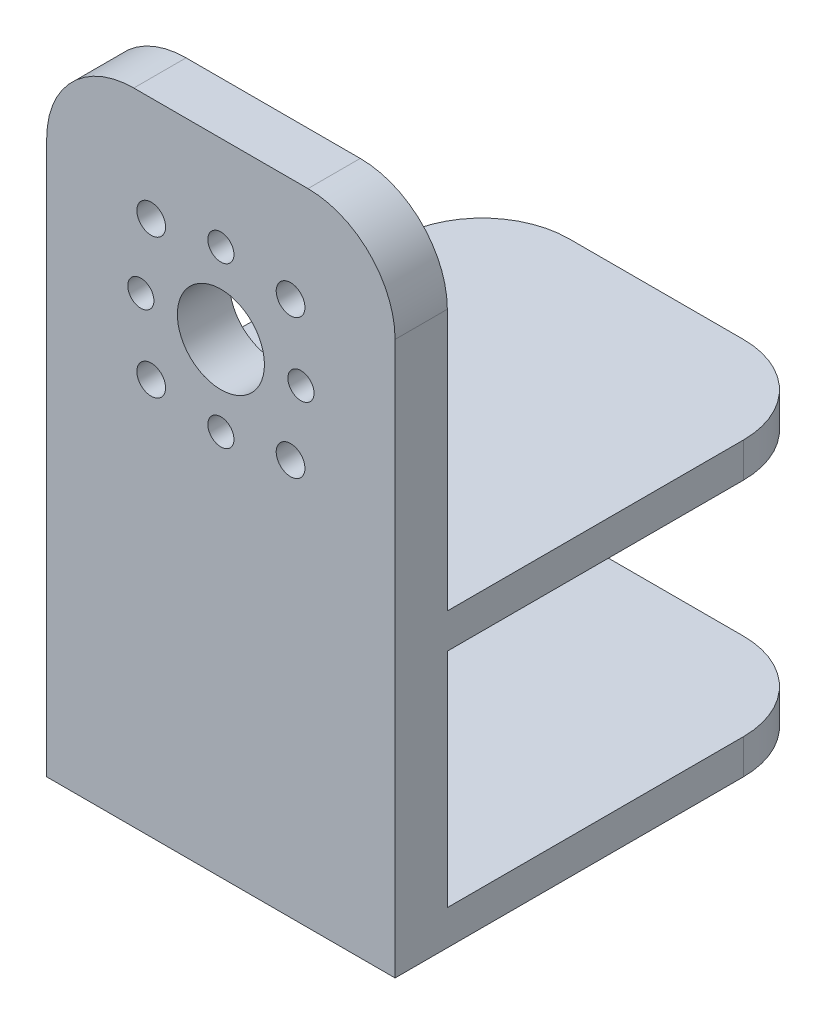
ISO-10303-21;
HEADER;
FILE_DESCRIPTION(('STEP AP214'),'2;1');
FILE_NAME('part.step','',(''),(''),'','','');
FILE_SCHEMA(('AUTOMOTIVE_DESIGN { 1 0 10303 214 1 1 1 1 }'));
ENDSEC;
DATA;
#1=APPLICATION_CONTEXT('core data for automotive mechanical design processes');
#2=APPLICATION_PROTOCOL_DEFINITION('international standard','automotive_design',2000,#1);
#3=PRODUCT_CONTEXT('',#1,'mechanical');
#4=PRODUCT('Part','Part','',(#3));
#5=PRODUCT_RELATED_PRODUCT_CATEGORY('part','',(#4));
#6=PRODUCT_DEFINITION_FORMATION('','',#4);
#7=PRODUCT_DEFINITION_CONTEXT('part definition',#1,'design');
#8=PRODUCT_DEFINITION('design','',#6,#7);
#9=PRODUCT_DEFINITION_SHAPE('','',#8);
#10=(LENGTH_UNIT() NAMED_UNIT(*) SI_UNIT(.MILLI.,.METRE.));
#11=(NAMED_UNIT(*) PLANE_ANGLE_UNIT() SI_UNIT($,.RADIAN.));
#12=(NAMED_UNIT(*) SI_UNIT($,.STERADIAN.) SOLID_ANGLE_UNIT());
#13=UNCERTAINTY_MEASURE_WITH_UNIT(LENGTH_MEASURE(1.E-05),#10,'distance_accuracy_value','');
#14=(GEOMETRIC_REPRESENTATION_CONTEXT(3) GLOBAL_UNCERTAINTY_ASSIGNED_CONTEXT((#13)) GLOBAL_UNIT_ASSIGNED_CONTEXT((#10,
#11,#12)) REPRESENTATION_CONTEXT('',''));
#15=CARTESIAN_POINT('',(0.,0.,0.));
#16=DIRECTION('',(0.,0.,1.));
#17=DIRECTION('',(1.,0.,0.));
#18=AXIS2_PLACEMENT_3D('',#15,#16,#17);
#19=CARTESIAN_POINT('',(20.,29.1923881554251,6.));
#20=DIRECTION('',(0.,0.,-1.));
#21=DIRECTION('',(-1.,0.,0.));
#22=AXIS2_PLACEMENT_3D('',#19,#20,#21);
#23=CYLINDRICAL_SURFACE('',#22,1.5);
#24=CARTESIAN_POINT('',(20.,29.1923881554251,6.));
#25=DIRECTION('',(0.,0.,1.));
#26=DIRECTION('',(1.,0.,0.));
#27=AXIS2_PLACEMENT_3D('',#24,#25,#26);
#28=CIRCLE('',#27,1.5);
#29=CARTESIAN_POINT('',(21.5,29.1923881554251,6.));
#30=VERTEX_POINT('',#29);
#31=EDGE_CURVE('E291',#30,#30,#28,.T.);
#32=ORIENTED_EDGE('',*,*,#31,.T.);
#33=EDGE_LOOP('',(#32));
#34=FACE_BOUND('',#33,.T.);
#35=CARTESIAN_POINT('',(20.,29.1923881554251,3.));
#36=DIRECTION('',(0.,0.,-1.));
#37=DIRECTION('',(-1.,0.,0.));
#38=AXIS2_PLACEMENT_3D('',#35,#36,#37);
#39=CIRCLE('',#38,1.5);
#40=CARTESIAN_POINT('',(18.5,29.1923881554251,3.));
#41=VERTEX_POINT('',#40);
#42=EDGE_CURVE('E251',#41,#41,#39,.T.);
#43=ORIENTED_EDGE('',*,*,#42,.T.);
#44=EDGE_LOOP('',(#43));
#45=FACE_BOUND('',#44,.T.);
#46=ADVANCED_FACE('F87',(#34,#45),#23,.F.);
#47=CARTESIAN_POINT('',(29.1923881554251,20.,6.));
#48=DIRECTION('',(0.,0.,-1.));
#49=DIRECTION('',(-1.,0.,0.));
#50=AXIS2_PLACEMENT_3D('',#47,#48,#49);
#51=CYLINDRICAL_SURFACE('',#50,1.5);
#52=CARTESIAN_POINT('',(29.1923881554251,20.,6.));
#53=DIRECTION('',(0.,0.,1.));
#54=DIRECTION('',(1.,0.,0.));
#55=AXIS2_PLACEMENT_3D('',#52,#53,#54);
#56=CIRCLE('',#55,1.5);
#57=CARTESIAN_POINT('',(30.6923881554251,20.,6.));
#58=VERTEX_POINT('',#57);
#59=EDGE_CURVE('E288',#58,#58,#56,.T.);
#60=ORIENTED_EDGE('',*,*,#59,.T.);
#61=EDGE_LOOP('',(#60));
#62=FACE_BOUND('',#61,.T.);
#63=CARTESIAN_POINT('',(29.1923881554251,20.,3.));
#64=DIRECTION('',(0.,0.,-1.));
#65=DIRECTION('',(-1.,0.,0.));
#66=AXIS2_PLACEMENT_3D('',#63,#64,#65);
#67=CIRCLE('',#66,1.5);
#68=CARTESIAN_POINT('',(27.6923881554251,20.,3.));
#69=VERTEX_POINT('',#68);
#70=EDGE_CURVE('E327',#69,#69,#67,.T.);
#71=ORIENTED_EDGE('',*,*,#70,.T.);
#72=EDGE_LOOP('',(#71));
#73=FACE_BOUND('',#72,.T.);
#74=ADVANCED_FACE('F500',(#62,#73),#51,.F.);
#75=CARTESIAN_POINT('',(20.,10.8076118445749,6.));
#76=DIRECTION('',(0.,0.,-1.));
#77=DIRECTION('',(-1.,0.,0.));
#78=AXIS2_PLACEMENT_3D('',#75,#76,#77);
#79=CYLINDRICAL_SURFACE('',#78,1.5);
#80=CARTESIAN_POINT('',(20.,10.8076118445749,6.));
#81=DIRECTION('',(0.,0.,1.));
#82=DIRECTION('',(1.,0.,0.));
#83=AXIS2_PLACEMENT_3D('',#80,#81,#82);
#84=CIRCLE('',#83,1.5);
#85=CARTESIAN_POINT('',(21.5,10.8076118445749,6.));
#86=VERTEX_POINT('',#85);
#87=EDGE_CURVE('E285',#86,#86,#84,.T.);
#88=ORIENTED_EDGE('',*,*,#87,.T.);
#89=EDGE_LOOP('',(#88));
#90=FACE_BOUND('',#89,.T.);
#91=CARTESIAN_POINT('',(20.,10.8076118445749,3.));
#92=DIRECTION('',(0.,0.,-1.));
#93=DIRECTION('',(-1.,0.,0.));
#94=AXIS2_PLACEMENT_3D('',#91,#92,#93);
#95=CIRCLE('',#94,1.5);
#96=CARTESIAN_POINT('',(18.5,10.8076118445749,3.));
#97=VERTEX_POINT('',#96);
#98=EDGE_CURVE('E323',#97,#97,#95,.T.);
#99=ORIENTED_EDGE('',*,*,#98,.T.);
#100=EDGE_LOOP('',(#99));
#101=FACE_BOUND('',#100,.T.);
#102=ADVANCED_FACE('F507',(#90,#101),#79,.F.);
#103=CARTESIAN_POINT('',(10.8076118445749,20.,6.));
#104=DIRECTION('',(0.,0.,-1.));
#105=DIRECTION('',(-1.,0.,0.));
#106=AXIS2_PLACEMENT_3D('',#103,#104,#105);
#107=CYLINDRICAL_SURFACE('',#106,1.49999999999999);
#108=CARTESIAN_POINT('',(10.8076118445749,20.,6.));
#109=DIRECTION('',(0.,0.,1.));
#110=DIRECTION('',(1.,0.,0.));
#111=AXIS2_PLACEMENT_3D('',#108,#109,#110);
#112=CIRCLE('',#111,1.49999999999999);
#113=CARTESIAN_POINT('',(12.3076118445749,20.,6.));
#114=VERTEX_POINT('',#113);
#115=EDGE_CURVE('E280',#114,#114,#112,.T.);
#116=ORIENTED_EDGE('',*,*,#115,.T.);
#117=EDGE_LOOP('',(#116));
#118=FACE_BOUND('',#117,.T.);
#119=CARTESIAN_POINT('',(10.8076118445749,20.,3.));
#120=DIRECTION('',(0.,0.,-1.));
#121=DIRECTION('',(-1.,0.,0.));
#122=AXIS2_PLACEMENT_3D('',#119,#120,#121);
#123=CIRCLE('',#122,1.49999999999999);
#124=CARTESIAN_POINT('',(9.30761184457488,20.,3.));
#125=VERTEX_POINT('',#124);
#126=EDGE_CURVE('E320',#125,#125,#123,.T.);
#127=ORIENTED_EDGE('',*,*,#126,.T.);
#128=EDGE_LOOP('',(#127));
#129=FACE_BOUND('',#128,.T.);
#130=ADVANCED_FACE('F514',(#118,#129),#107,.F.);
#131=CARTESIAN_POINT('',(0.,0.,6.));
#132=DIRECTION('',(0.,0.,-1.));
#133=DIRECTION('',(-1.,0.,0.));
#134=AXIS2_PLACEMENT_3D('',#131,#132,#133);
#135=PLANE('',#134);
#136=DIRECTION('',(0.,1.,0.));
#137=VECTOR('',#136,1.);
#138=CARTESIAN_POINT('',(40.,0.,6.));
#139=LINE('',#138,#137);
#140=CARTESIAN_POINT('',(40.,-33.5,6.));
#141=VERTEX_POINT('',#140);
#142=CARTESIAN_POINT('',(40.,30.,6.));
#143=VERTEX_POINT('',#142);
#144=EDGE_CURVE('E303',#141,#143,#139,.T.);
#145=ORIENTED_EDGE('',*,*,#144,.T.);
#146=CARTESIAN_POINT('',(30.,30.,6.));
#147=DIRECTION('',(0.,0.,-1.));
#148=DIRECTION('',(-1.,0.,0.));
#149=AXIS2_PLACEMENT_3D('',#146,#147,#148);
#150=CIRCLE('',#149,10.);
#151=CARTESIAN_POINT('',(30.,40.,6.));
#152=VERTEX_POINT('',#151);
#153=EDGE_CURVE('E360',#143,#152,#150,.F.);
#154=ORIENTED_EDGE('',*,*,#153,.T.);
#155=DIRECTION('',(-1.,0.,0.));
#156=VECTOR('',#155,1.);
#157=CARTESIAN_POINT('',(0.,40.,6.));
#158=LINE('',#157,#156);
#159=CARTESIAN_POINT('',(10.,40.,6.));
#160=VERTEX_POINT('',#159);
#161=EDGE_CURVE('E307',#152,#160,#158,.T.);
#162=ORIENTED_EDGE('',*,*,#161,.T.);
#163=CARTESIAN_POINT('',(10.,30.,6.));
#164=DIRECTION('',(0.,0.,-1.));
#165=DIRECTION('',(-1.,0.,0.));
#166=AXIS2_PLACEMENT_3D('',#163,#164,#165);
#167=CIRCLE('',#166,10.);
#168=CARTESIAN_POINT('',(0.,30.,6.));
#169=VERTEX_POINT('',#168);
#170=EDGE_CURVE('E358',#160,#169,#167,.F.);
#171=ORIENTED_EDGE('',*,*,#170,.T.);
#172=DIRECTION('',(0.,-1.,0.));
#173=VECTOR('',#172,1.);
#174=CARTESIAN_POINT('',(0.,0.,6.));
#175=LINE('',#174,#173);
#176=CARTESIAN_POINT('',(0.,-33.5,6.));
#177=VERTEX_POINT('',#176);
#178=EDGE_CURVE('E301',#169,#177,#175,.T.);
#179=ORIENTED_EDGE('',*,*,#178,.T.);
#180=DIRECTION('',(1.,0.,0.));
#181=VECTOR('',#180,1.);
#182=CARTESIAN_POINT('',(0.,-33.5,6.));
#183=LINE('',#182,#181);
#184=EDGE_CURVE('E220',#177,#141,#183,.T.);
#185=ORIENTED_EDGE('',*,*,#184,.T.);
#186=EDGE_LOOP('',(#145,#154,#162,#171,#179,#185));
#187=FACE_BOUND('',#186,.T.);
#188=CARTESIAN_POINT('',(20.,20.,6.));
#189=DIRECTION('',(0.,0.,1.));
#190=DIRECTION('',(1.,0.,0.));
#191=AXIS2_PLACEMENT_3D('',#188,#189,#190);
#192=CIRCLE('',#191,5.);
#193=CARTESIAN_POINT('',(25.,20.,6.));
#194=VERTEX_POINT('',#193);
#195=EDGE_CURVE('E295',#194,#194,#192,.T.);
#196=ORIENTED_EDGE('',*,*,#195,.F.);
#197=EDGE_LOOP('',(#196));
#198=FACE_BOUND('',#197,.T.);
#199=ORIENTED_EDGE('',*,*,#31,.F.);
#200=EDGE_LOOP('',(#199));
#201=FACE_BOUND('',#200,.T.);
#202=ORIENTED_EDGE('',*,*,#59,.F.);
#203=EDGE_LOOP('',(#202));
#204=FACE_BOUND('',#203,.T.);
#205=ORIENTED_EDGE('',*,*,#87,.F.);
#206=EDGE_LOOP('',(#205));
#207=FACE_BOUND('',#206,.T.);
#208=ORIENTED_EDGE('',*,*,#115,.F.);
#209=EDGE_LOOP('',(#208));
#210=FACE_BOUND('',#209,.T.);
#211=CARTESIAN_POINT('',(28.,28.,6.));
#212=DIRECTION('',(0.,0.,1.));
#213=DIRECTION('',(1.,0.,0.));
#214=AXIS2_PLACEMENT_3D('',#211,#212,#213);
#215=CIRCLE('',#214,1.65);
#216=CARTESIAN_POINT('',(29.65,28.,6.));
#217=VERTEX_POINT('',#216);
#218=EDGE_CURVE('E277',#217,#217,#215,.T.);
#219=ORIENTED_EDGE('',*,*,#218,.F.);
#220=EDGE_LOOP('',(#219));
#221=FACE_BOUND('',#220,.T.);
#222=CARTESIAN_POINT('',(12.,28.,6.));
#223=DIRECTION('',(0.,0.,1.));
#224=DIRECTION('',(1.,0.,0.));
#225=AXIS2_PLACEMENT_3D('',#222,#223,#224);
#226=CIRCLE('',#225,1.65);
#227=CARTESIAN_POINT('',(13.65,28.,6.));
#228=VERTEX_POINT('',#227);
#229=EDGE_CURVE('E271',#228,#228,#226,.T.);
#230=ORIENTED_EDGE('',*,*,#229,.F.);
#231=EDGE_LOOP('',(#230));
#232=FACE_BOUND('',#231,.T.);
#233=CARTESIAN_POINT('',(12.,12.,6.));
#234=DIRECTION('',(0.,0.,1.));
#235=DIRECTION('',(1.,0.,0.));
#236=AXIS2_PLACEMENT_3D('',#233,#234,#235);
#237=CIRCLE('',#236,1.65);
#238=CARTESIAN_POINT('',(13.65,12.,6.));
#239=VERTEX_POINT('',#238);
#240=EDGE_CURVE('E265',#239,#239,#237,.T.);
#241=ORIENTED_EDGE('',*,*,#240,.F.);
#242=EDGE_LOOP('',(#241));
#243=FACE_BOUND('',#242,.T.);
#244=CARTESIAN_POINT('',(28.,12.,6.));
#245=DIRECTION('',(0.,0.,1.));
#246=DIRECTION('',(1.,0.,0.));
#247=AXIS2_PLACEMENT_3D('',#244,#245,#246);
#248=CIRCLE('',#247,1.65);
#249=CARTESIAN_POINT('',(29.65,12.,6.));
#250=VERTEX_POINT('',#249);
#251=EDGE_CURVE('E259',#250,#250,#248,.T.);
#252=ORIENTED_EDGE('',*,*,#251,.F.);
#253=EDGE_LOOP('',(#252));
#254=FACE_BOUND('',#253,.T.);
#255=ADVANCED_FACE('F400',(#187,#198,#201,#204,#207,#210,#221,#232,#243,#254),#135,.F.);
#256=CARTESIAN_POINT('',(0.,0.,0.));
#257=DIRECTION('',(0.,0.,-1.));
#258=DIRECTION('',(-1.,0.,0.));
#259=AXIS2_PLACEMENT_3D('',#256,#257,#258);
#260=PLANE('',#259);
#261=CARTESIAN_POINT('',(20.,29.1923881554251,0.));
#262=DIRECTION('',(0.,0.,-1.));
#263=DIRECTION('',(-1.,0.,0.));
#264=AXIS2_PLACEMENT_3D('',#261,#262,#263);
#265=CIRCLE('',#264,3.5);
#266=CARTESIAN_POINT('',(16.5,29.1923881554251,0.));
#267=VERTEX_POINT('',#266);
#268=EDGE_CURVE('E455',#267,#267,#265,.T.);
#269=ORIENTED_EDGE('',*,*,#268,.F.);
#270=EDGE_LOOP('',(#269));
#271=FACE_BOUND('',#270,.T.);
#272=CARTESIAN_POINT('',(20.,10.8076118445749,0.));
#273=DIRECTION('',(0.,0.,-1.));
#274=DIRECTION('',(-1.,0.,0.));
#275=AXIS2_PLACEMENT_3D('',#272,#273,#274);
#276=CIRCLE('',#275,3.5);
#277=CARTESIAN_POINT('',(16.5,10.8076118445749,0.));
#278=VERTEX_POINT('',#277);
#279=EDGE_CURVE('E452',#278,#278,#276,.T.);
#280=ORIENTED_EDGE('',*,*,#279,.F.);
#281=EDGE_LOOP('',(#280));
#282=FACE_BOUND('',#281,.T.);
#283=CARTESIAN_POINT('',(29.1923881554251,20.,0.));
#284=DIRECTION('',(0.,0.,-1.));
#285=DIRECTION('',(-1.,0.,0.));
#286=AXIS2_PLACEMENT_3D('',#283,#284,#285);
#287=CIRCLE('',#286,3.5);
#288=CARTESIAN_POINT('',(25.6923881554251,20.,0.));
#289=VERTEX_POINT('',#288);
#290=EDGE_CURVE('E446',#289,#289,#287,.T.);
#291=ORIENTED_EDGE('',*,*,#290,.F.);
#292=EDGE_LOOP('',(#291));
#293=FACE_BOUND('',#292,.T.);
#294=CARTESIAN_POINT('',(10.8076118445749,20.,0.));
#295=DIRECTION('',(0.,0.,-1.));
#296=DIRECTION('',(-1.,0.,0.));
#297=AXIS2_PLACEMENT_3D('',#294,#295,#296);
#298=CIRCLE('',#297,3.5);
#299=CARTESIAN_POINT('',(7.30761184457487,20.,0.));
#300=VERTEX_POINT('',#299);
#301=EDGE_CURVE('E440',#300,#300,#298,.T.);
#302=ORIENTED_EDGE('',*,*,#301,.F.);
#303=EDGE_LOOP('',(#302));
#304=FACE_BOUND('',#303,.T.);
#305=CARTESIAN_POINT('',(12.,12.,0.));
#306=DIRECTION('',(0.,0.,1.));
#307=DIRECTION('',(1.,0.,0.));
#308=AXIS2_PLACEMENT_3D('',#305,#306,#307);
#309=CIRCLE('',#308,1.65);
#310=CARTESIAN_POINT('',(13.65,12.,0.));
#311=VERTEX_POINT('',#310);
#312=EDGE_CURVE('E262',#311,#311,#309,.T.);
#313=ORIENTED_EDGE('',*,*,#312,.T.);
#314=EDGE_LOOP('',(#313));
#315=FACE_BOUND('',#314,.T.);
#316=CARTESIAN_POINT('',(28.,28.,0.));
#317=DIRECTION('',(0.,0.,1.));
#318=DIRECTION('',(1.,0.,0.));
#319=AXIS2_PLACEMENT_3D('',#316,#317,#318);
#320=CIRCLE('',#319,1.65);
#321=CARTESIAN_POINT('',(29.65,28.,0.));
#322=VERTEX_POINT('',#321);
#323=EDGE_CURVE('E274',#322,#322,#320,.T.);
#324=ORIENTED_EDGE('',*,*,#323,.T.);
#325=EDGE_LOOP('',(#324));
#326=FACE_BOUND('',#325,.T.);
#327=DIRECTION('',(-1.,0.,0.));
#328=VECTOR('',#327,1.);
#329=CARTESIAN_POINT('',(0.,40.,0.));
#330=LINE('',#329,#328);
#331=CARTESIAN_POINT('',(30.,40.,0.));
#332=VERTEX_POINT('',#331);
#333=CARTESIAN_POINT('',(10.,40.,0.));
#334=VERTEX_POINT('',#333);
#335=EDGE_CURVE('E304',#332,#334,#330,.T.);
#336=ORIENTED_EDGE('',*,*,#335,.F.);
#337=CARTESIAN_POINT('',(30.,30.,0.));
#338=DIRECTION('',(0.,0.,-1.));
#339=DIRECTION('',(-1.,0.,0.));
#340=AXIS2_PLACEMENT_3D('',#337,#338,#339);
#341=CIRCLE('',#340,10.);
#342=CARTESIAN_POINT('',(40.,30.,0.));
#343=VERTEX_POINT('',#342);
#344=EDGE_CURVE('E356',#332,#343,#341,.T.);
#345=ORIENTED_EDGE('',*,*,#344,.T.);
#346=DIRECTION('',(0.,1.,0.));
#347=VECTOR('',#346,1.);
#348=CARTESIAN_POINT('',(40.,0.,0.));
#349=LINE('',#348,#347);
#350=CARTESIAN_POINT('',(40.,0.,0.));
#351=VERTEX_POINT('',#350);
#352=EDGE_CURVE('E315',#351,#343,#349,.T.);
#353=ORIENTED_EDGE('',*,*,#352,.F.);
#354=DIRECTION('',(1.,0.,0.));
#355=VECTOR('',#354,1.);
#356=CARTESIAN_POINT('',(0.,0.,0.));
#357=LINE('',#356,#355);
#358=CARTESIAN_POINT('',(0.,0.,0.));
#359=VERTEX_POINT('',#358);
#360=EDGE_CURVE('E312',#359,#351,#357,.T.);
#361=ORIENTED_EDGE('',*,*,#360,.F.);
#362=DIRECTION('',(0.,-1.,0.));
#363=VECTOR('',#362,1.);
#364=CARTESIAN_POINT('',(0.,0.,0.));
#365=LINE('',#364,#363);
#366=CARTESIAN_POINT('',(0.,30.,0.));
#367=VERTEX_POINT('',#366);
#368=EDGE_CURVE('E298',#367,#359,#365,.T.);
#369=ORIENTED_EDGE('',*,*,#368,.F.);
#370=CARTESIAN_POINT('',(10.,30.,0.));
#371=DIRECTION('',(0.,0.,-1.));
#372=DIRECTION('',(-1.,0.,0.));
#373=AXIS2_PLACEMENT_3D('',#370,#371,#372);
#374=CIRCLE('',#373,10.);
#375=EDGE_CURVE('E354',#367,#334,#374,.T.);
#376=ORIENTED_EDGE('',*,*,#375,.T.);
#377=EDGE_LOOP('',(#336,#345,#353,#361,#369,#376));
#378=FACE_BOUND('',#377,.T.);
#379=CARTESIAN_POINT('',(20.,20.,0.));
#380=DIRECTION('',(0.,0.,1.));
#381=DIRECTION('',(1.,0.,0.));
#382=AXIS2_PLACEMENT_3D('',#379,#380,#381);
#383=CIRCLE('',#382,5.);
#384=CARTESIAN_POINT('',(25.,20.,0.));
#385=VERTEX_POINT('',#384);
#386=EDGE_CURVE('E294',#385,#385,#383,.T.);
#387=ORIENTED_EDGE('',*,*,#386,.T.);
#388=EDGE_LOOP('',(#387));
#389=FACE_BOUND('',#388,.T.);
#390=CARTESIAN_POINT('',(12.,28.,0.));
#391=DIRECTION('',(0.,0.,1.));
#392=DIRECTION('',(1.,0.,0.));
#393=AXIS2_PLACEMENT_3D('',#390,#391,#392);
#394=CIRCLE('',#393,1.65);
#395=CARTESIAN_POINT('',(13.65,28.,0.));
#396=VERTEX_POINT('',#395);
#397=EDGE_CURVE('E268',#396,#396,#394,.T.);
#398=ORIENTED_EDGE('',*,*,#397,.T.);
#399=EDGE_LOOP('',(#398));
#400=FACE_BOUND('',#399,.T.);
#401=CARTESIAN_POINT('',(28.,12.,0.));
#402=DIRECTION('',(0.,0.,1.));
#403=DIRECTION('',(1.,0.,0.));
#404=AXIS2_PLACEMENT_3D('',#401,#402,#403);
#405=CIRCLE('',#404,1.65);
#406=CARTESIAN_POINT('',(29.65,12.,0.));
#407=VERTEX_POINT('',#406);
#408=EDGE_CURVE('E210',#407,#407,#405,.T.);
#409=ORIENTED_EDGE('',*,*,#408,.T.);
#410=EDGE_LOOP('',(#409));
#411=FACE_BOUND('',#410,.T.);
#412=ADVANCED_FACE('F410',(#271,#282,#293,#304,#315,#326,#378,#389,#400,#411),#260,.T.);
#413=CARTESIAN_POINT('',(0.,0.,6.));
#414=DIRECTION('',(1.,0.,0.));
#415=DIRECTION('',(0.,0.,-1.));
#416=AXIS2_PLACEMENT_3D('',#413,#414,#415);
#417=PLANE('',#416);
#418=ORIENTED_EDGE('',*,*,#178,.F.);
#419=DIRECTION('',(0.,0.,-1.));
#420=VECTOR('',#419,1.);
#421=CARTESIAN_POINT('',(0.,30.,6.));
#422=LINE('',#421,#420);
#423=EDGE_CURVE('E368',#169,#367,#422,.T.);
#424=ORIENTED_EDGE('',*,*,#423,.T.);
#425=ORIENTED_EDGE('',*,*,#368,.T.);
#426=DIRECTION('',(0.,0.,-1.));
#427=VECTOR('',#426,1.);
#428=CARTESIAN_POINT('',(0.,0.,6.));
#429=LINE('',#428,#427);
#430=CARTESIAN_POINT('',(0.,0.,-34.));
#431=VERTEX_POINT('',#430);
#432=EDGE_CURVE('E233',#359,#431,#429,.T.);
#433=ORIENTED_EDGE('',*,*,#432,.T.);
#434=DIRECTION('',(0.,-1.,0.));
#435=VECTOR('',#434,1.);
#436=CARTESIAN_POINT('',(0.,0.,-34.));
#437=LINE('',#436,#435);
#438=CARTESIAN_POINT('',(0.,-4.,-34.));
#439=VERTEX_POINT('',#438);
#440=EDGE_CURVE('E362',#431,#439,#437,.T.);
#441=ORIENTED_EDGE('',*,*,#440,.T.);
#442=DIRECTION('',(0.,0.,-1.));
#443=VECTOR('',#442,1.);
#444=CARTESIAN_POINT('',(0.,-4.,6.));
#445=LINE('',#444,#443);
#446=CARTESIAN_POINT('',(0.,-4.,0.));
#447=VERTEX_POINT('',#446);
#448=EDGE_CURVE('E229',#447,#439,#445,.T.);
#449=ORIENTED_EDGE('',*,*,#448,.F.);
#450=DIRECTION('',(0.,-1.,0.));
#451=VECTOR('',#450,1.);
#452=CARTESIAN_POINT('',(0.,-4.,0.));
#453=LINE('',#452,#451);
#454=CARTESIAN_POINT('',(0.,-29.5,0.));
#455=VERTEX_POINT('',#454);
#456=EDGE_CURVE('E205',#447,#455,#453,.T.);
#457=ORIENTED_EDGE('',*,*,#456,.T.);
#458=DIRECTION('',(0.,0.,-1.));
#459=VECTOR('',#458,1.);
#460=CARTESIAN_POINT('',(0.,-29.5,6.));
#461=LINE('',#460,#459);
#462=CARTESIAN_POINT('',(0.,-29.5,-34.));
#463=VERTEX_POINT('',#462);
#464=EDGE_CURVE('E244',#455,#463,#461,.T.);
#465=ORIENTED_EDGE('',*,*,#464,.T.);
#466=DIRECTION('',(0.,-1.,0.));
#467=VECTOR('',#466,1.);
#468=CARTESIAN_POINT('',(0.,0.,-34.0000000000001));
#469=LINE('',#468,#467);
#470=CARTESIAN_POINT('',(0.,-33.5,-34.));
#471=VERTEX_POINT('',#470);
#472=EDGE_CURVE('E365',#463,#471,#469,.T.);
#473=ORIENTED_EDGE('',*,*,#472,.T.);
#474=DIRECTION('',(0.,0.,-1.));
#475=VECTOR('',#474,1.);
#476=CARTESIAN_POINT('',(0.,-33.5,6.));
#477=LINE('',#476,#475);
#478=EDGE_CURVE('E241',#177,#471,#477,.T.);
#479=ORIENTED_EDGE('',*,*,#478,.F.);
#480=EDGE_LOOP('',(#418,#424,#425,#433,#441,#449,#457,#465,#473,#479));
#481=FACE_BOUND('',#480,.T.);
#482=ADVANCED_FACE('F385',(#481),#417,.F.);
#483=CARTESIAN_POINT('',(40.,0.,6.));
#484=DIRECTION('',(-1.,0.,0.));
#485=DIRECTION('',(0.,0.,1.));
#486=AXIS2_PLACEMENT_3D('',#483,#484,#485);
#487=PLANE('',#486);
#488=DIRECTION('',(0.,0.,-1.));
#489=VECTOR('',#488,1.);
#490=CARTESIAN_POINT('',(40.,-4.,6.));
#491=LINE('',#490,#489);
#492=CARTESIAN_POINT('',(40.,-4.,0.));
#493=VERTEX_POINT('',#492);
#494=CARTESIAN_POINT('',(40.,-4.,-34.));
#495=VERTEX_POINT('',#494);
#496=EDGE_CURVE('E217',#493,#495,#491,.T.);
#497=ORIENTED_EDGE('',*,*,#496,.T.);
#498=DIRECTION('',(0.,-1.,0.));
#499=VECTOR('',#498,1.);
#500=CARTESIAN_POINT('',(40.,0.,-34.));
#501=LINE('',#500,#499);
#502=CARTESIAN_POINT('',(40.,0.,-34.));
#503=VERTEX_POINT('',#502);
#504=EDGE_CURVE('E343',#495,#503,#501,.F.);
#505=ORIENTED_EDGE('',*,*,#504,.T.);
#506=DIRECTION('',(0.,0.,-1.));
#507=VECTOR('',#506,1.);
#508=CARTESIAN_POINT('',(40.,0.,6.));
#509=LINE('',#508,#507);
#510=EDGE_CURVE('E225',#351,#503,#509,.T.);
#511=ORIENTED_EDGE('',*,*,#510,.F.);
#512=ORIENTED_EDGE('',*,*,#352,.T.);
#513=DIRECTION('',(0.,0.,-1.));
#514=VECTOR('',#513,1.);
#515=CARTESIAN_POINT('',(40.,30.,6.));
#516=LINE('',#515,#514);
#517=EDGE_CURVE('E341',#343,#143,#516,.F.);
#518=ORIENTED_EDGE('',*,*,#517,.T.);
#519=ORIENTED_EDGE('',*,*,#144,.F.);
#520=DIRECTION('',(0.,0.,-1.));
#521=VECTOR('',#520,1.);
#522=CARTESIAN_POINT('',(40.,-33.5,6.));
#523=LINE('',#522,#521);
#524=CARTESIAN_POINT('',(40.,-33.5,-34.));
#525=VERTEX_POINT('',#524);
#526=EDGE_CURVE('E248',#141,#525,#523,.T.);
#527=ORIENTED_EDGE('',*,*,#526,.T.);
#528=DIRECTION('',(0.,-1.,0.));
#529=VECTOR('',#528,1.);
#530=CARTESIAN_POINT('',(40.,0.,-34.0000000000001));
#531=LINE('',#530,#529);
#532=CARTESIAN_POINT('',(40.,-29.5,-34.));
#533=VERTEX_POINT('',#532);
#534=EDGE_CURVE('E339',#525,#533,#531,.F.);
#535=ORIENTED_EDGE('',*,*,#534,.T.);
#536=DIRECTION('',(0.,0.,-1.));
#537=VECTOR('',#536,1.);
#538=CARTESIAN_POINT('',(40.,-29.5,6.));
#539=LINE('',#538,#537);
#540=CARTESIAN_POINT('',(40.,-29.5,0.));
#541=VERTEX_POINT('',#540);
#542=EDGE_CURVE('E219',#541,#533,#539,.T.);
#543=ORIENTED_EDGE('',*,*,#542,.F.);
#544=DIRECTION('',(0.,-1.,0.));
#545=VECTOR('',#544,1.);
#546=CARTESIAN_POINT('',(40.,-4.,0.));
#547=LINE('',#546,#545);
#548=EDGE_CURVE('E203',#493,#541,#547,.T.);
#549=ORIENTED_EDGE('',*,*,#548,.F.);
#550=EDGE_LOOP('',(#497,#505,#511,#512,#518,#519,#527,#535,#543,#549));
#551=FACE_BOUND('',#550,.T.);
#552=ADVANCED_FACE('F216',(#551),#487,.F.);
#553=CARTESIAN_POINT('',(0.,40.,6.));
#554=DIRECTION('',(0.,-1.,0.));
#555=DIRECTION('',(0.,0.,-1.));
#556=AXIS2_PLACEMENT_3D('',#553,#554,#555);
#557=PLANE('',#556);
#558=ORIENTED_EDGE('',*,*,#161,.F.);
#559=DIRECTION('',(0.,0.,-1.));
#560=VECTOR('',#559,1.);
#561=CARTESIAN_POINT('',(30.,40.,6.));
#562=LINE('',#561,#560);
#563=EDGE_CURVE('E351',#152,#332,#562,.T.);
#564=ORIENTED_EDGE('',*,*,#563,.T.);
#565=ORIENTED_EDGE('',*,*,#335,.T.);
#566=DIRECTION('',(0.,0.,-1.));
#567=VECTOR('',#566,1.);
#568=CARTESIAN_POINT('',(10.,40.,6.));
#569=LINE('',#568,#567);
#570=EDGE_CURVE('E349',#334,#160,#569,.F.);
#571=ORIENTED_EDGE('',*,*,#570,.T.);
#572=EDGE_LOOP('',(#558,#564,#565,#571));
#573=FACE_BOUND('',#572,.T.);
#574=ADVANCED_FACE('F415',(#573),#557,.F.);
#575=CARTESIAN_POINT('',(20.,20.,6.));
#576=DIRECTION('',(0.,0.,-1.));
#577=DIRECTION('',(-1.,0.,0.));
#578=AXIS2_PLACEMENT_3D('',#575,#576,#577);
#579=CYLINDRICAL_SURFACE('',#578,5.);
#580=ORIENTED_EDGE('',*,*,#195,.T.);
#581=EDGE_LOOP('',(#580));
#582=FACE_BOUND('',#581,.T.);
#583=ORIENTED_EDGE('',*,*,#386,.F.);
#584=EDGE_LOOP('',(#583));
#585=FACE_BOUND('',#584,.T.);
#586=ADVANCED_FACE('F486',(#582,#585),#579,.F.);
#587=CARTESIAN_POINT('',(28.,28.,6.));
#588=DIRECTION('',(0.,0.,-1.));
#589=DIRECTION('',(-1.,0.,0.));
#590=AXIS2_PLACEMENT_3D('',#587,#588,#589);
#591=CYLINDRICAL_SURFACE('',#590,1.65);
#592=ORIENTED_EDGE('',*,*,#218,.T.);
#593=EDGE_LOOP('',(#592));
#594=FACE_BOUND('',#593,.T.);
#595=ORIENTED_EDGE('',*,*,#323,.F.);
#596=EDGE_LOOP('',(#595));
#597=FACE_BOUND('',#596,.T.);
#598=ADVANCED_FACE('F483',(#594,#597),#591,.F.);
#599=CARTESIAN_POINT('',(12.,28.,6.));
#600=DIRECTION('',(0.,0.,-1.));
#601=DIRECTION('',(-1.,0.,0.));
#602=AXIS2_PLACEMENT_3D('',#599,#600,#601);
#603=CYLINDRICAL_SURFACE('',#602,1.65);
#604=ORIENTED_EDGE('',*,*,#229,.T.);
#605=EDGE_LOOP('',(#604));
#606=FACE_BOUND('',#605,.T.);
#607=ORIENTED_EDGE('',*,*,#397,.F.);
#608=EDGE_LOOP('',(#607));
#609=FACE_BOUND('',#608,.T.);
#610=ADVANCED_FACE('F485',(#606,#609),#603,.F.);
#611=CARTESIAN_POINT('',(12.,12.,6.));
#612=DIRECTION('',(0.,0.,-1.));
#613=DIRECTION('',(-1.,0.,0.));
#614=AXIS2_PLACEMENT_3D('',#611,#612,#613);
#615=CYLINDRICAL_SURFACE('',#614,1.65);
#616=ORIENTED_EDGE('',*,*,#240,.T.);
#617=EDGE_LOOP('',(#616));
#618=FACE_BOUND('',#617,.T.);
#619=ORIENTED_EDGE('',*,*,#312,.F.);
#620=EDGE_LOOP('',(#619));
#621=FACE_BOUND('',#620,.T.);
#622=ADVANCED_FACE('F493',(#618,#621),#615,.F.);
#623=CARTESIAN_POINT('',(28.,12.,6.));
#624=DIRECTION('',(0.,0.,-1.));
#625=DIRECTION('',(-1.,0.,0.));
#626=AXIS2_PLACEMENT_3D('',#623,#624,#625);
#627=CYLINDRICAL_SURFACE('',#626,1.65);
#628=ORIENTED_EDGE('',*,*,#251,.T.);
#629=EDGE_LOOP('',(#628));
#630=FACE_BOUND('',#629,.T.);
#631=ORIENTED_EDGE('',*,*,#408,.F.);
#632=EDGE_LOOP('',(#631));
#633=FACE_BOUND('',#632,.T.);
#634=ADVANCED_FACE('F718',(#630,#633),#627,.F.);
#635=CARTESIAN_POINT('',(0.,0.,6.));
#636=DIRECTION('',(0.,-1.,0.));
#637=DIRECTION('',(0.,0.,-1.));
#638=AXIS2_PLACEMENT_3D('',#635,#636,#637);
#639=PLANE('',#638);
#640=ORIENTED_EDGE('',*,*,#510,.T.);
#641=CARTESIAN_POINT('',(30.,0.,-34.));
#642=DIRECTION('',(0.,-1.,0.));
#643=DIRECTION('',(0.,0.,-1.));
#644=AXIS2_PLACEMENT_3D('',#641,#642,#643);
#645=CIRCLE('',#644,10.);
#646=CARTESIAN_POINT('',(30.,0.,-44.));
#647=VERTEX_POINT('',#646);
#648=EDGE_CURVE('E347',#503,#647,#645,.F.);
#649=ORIENTED_EDGE('',*,*,#648,.T.);
#650=DIRECTION('',(1.,0.,0.));
#651=VECTOR('',#650,1.);
#652=CARTESIAN_POINT('',(0.,0.,-44.));
#653=LINE('',#652,#651);
#654=CARTESIAN_POINT('',(10.,0.,-44.));
#655=VERTEX_POINT('',#654);
#656=EDGE_CURVE('E211',#655,#647,#653,.T.);
#657=ORIENTED_EDGE('',*,*,#656,.F.);
#658=CARTESIAN_POINT('',(10.,0.,-34.));
#659=DIRECTION('',(0.,-1.,0.));
#660=DIRECTION('',(0.,0.,-1.));
#661=AXIS2_PLACEMENT_3D('',#658,#659,#660);
#662=CIRCLE('',#661,10.);
#663=EDGE_CURVE('E345',#655,#431,#662,.F.);
#664=ORIENTED_EDGE('',*,*,#663,.T.);
#665=ORIENTED_EDGE('',*,*,#432,.F.);
#666=ORIENTED_EDGE('',*,*,#360,.T.);
#667=EDGE_LOOP('',(#640,#649,#657,#664,#665,#666));
#668=FACE_BOUND('',#667,.T.);
#669=ADVANCED_FACE('F422',(#668),#639,.F.);
#670=CARTESIAN_POINT('',(0.,-4.,6.));
#671=DIRECTION('',(0.,-1.,0.));
#672=DIRECTION('',(0.,0.,-1.));
#673=AXIS2_PLACEMENT_3D('',#670,#671,#672);
#674=PLANE('',#673);
#675=DIRECTION('',(1.,0.,0.));
#676=VECTOR('',#675,1.);
#677=CARTESIAN_POINT('',(0.,-4.,-44.));
#678=LINE('',#677,#676);
#679=CARTESIAN_POINT('',(10.,-4.,-44.));
#680=VERTEX_POINT('',#679);
#681=CARTESIAN_POINT('',(30.,-4.,-44.));
#682=VERTEX_POINT('',#681);
#683=EDGE_CURVE('E238',#680,#682,#678,.T.);
#684=ORIENTED_EDGE('',*,*,#683,.T.);
#685=CARTESIAN_POINT('',(30.,-4.,-34.));
#686=DIRECTION('',(0.,-1.,0.));
#687=DIRECTION('',(0.,0.,-1.));
#688=AXIS2_PLACEMENT_3D('',#685,#686,#687);
#689=CIRCLE('',#688,10.);
#690=EDGE_CURVE('E224',#682,#495,#689,.T.);
#691=ORIENTED_EDGE('',*,*,#690,.T.);
#692=ORIENTED_EDGE('',*,*,#496,.F.);
#693=DIRECTION('',(1.,0.,0.));
#694=VECTOR('',#693,1.);
#695=CARTESIAN_POINT('',(0.,-4.,0.));
#696=LINE('',#695,#694);
#697=EDGE_CURVE('E200',#447,#493,#696,.T.);
#698=ORIENTED_EDGE('',*,*,#697,.F.);
#699=ORIENTED_EDGE('',*,*,#448,.T.);
#700=CARTESIAN_POINT('',(10.,-4.,-34.));
#701=DIRECTION('',(0.,-1.,0.));
#702=DIRECTION('',(0.,0.,-1.));
#703=AXIS2_PLACEMENT_3D('',#700,#701,#702);
#704=CIRCLE('',#703,10.);
#705=EDGE_CURVE('E336',#439,#680,#704,.T.);
#706=ORIENTED_EDGE('',*,*,#705,.T.);
#707=EDGE_LOOP('',(#684,#691,#692,#698,#699,#706));
#708=FACE_BOUND('',#707,.T.);
#709=ADVANCED_FACE('F223',(#708),#674,.T.);
#710=CARTESIAN_POINT('',(0.,0.,-44.));
#711=DIRECTION('',(0.,0.,1.));
#712=DIRECTION('',(0.,-1.,0.));
#713=AXIS2_PLACEMENT_3D('',#710,#711,#712);
#714=PLANE('',#713);
#715=ORIENTED_EDGE('',*,*,#656,.T.);
#716=DIRECTION('',(0.,-1.,0.));
#717=VECTOR('',#716,1.);
#718=CARTESIAN_POINT('',(30.,0.,-44.));
#719=LINE('',#718,#717);
#720=EDGE_CURVE('E333',#647,#682,#719,.T.);
#721=ORIENTED_EDGE('',*,*,#720,.T.);
#722=ORIENTED_EDGE('',*,*,#683,.F.);
#723=DIRECTION('',(0.,-1.,0.));
#724=VECTOR('',#723,1.);
#725=CARTESIAN_POINT('',(10.,0.,-44.));
#726=LINE('',#725,#724);
#727=EDGE_CURVE('E310',#680,#655,#726,.F.);
#728=ORIENTED_EDGE('',*,*,#727,.T.);
#729=EDGE_LOOP('',(#715,#721,#722,#728));
#730=FACE_BOUND('',#729,.T.);
#731=ADVANCED_FACE('F430',(#730),#714,.F.);
#732=CARTESIAN_POINT('',(0.,-33.5,6.));
#733=DIRECTION('',(0.,-1.,0.));
#734=DIRECTION('',(0.,0.,-1.));
#735=AXIS2_PLACEMENT_3D('',#732,#733,#734);
#736=PLANE('',#735);
#737=DIRECTION('',(1.,0.,0.));
#738=VECTOR('',#737,1.);
#739=CARTESIAN_POINT('',(0.,-33.5,-44.));
#740=LINE('',#739,#738);
#741=CARTESIAN_POINT('',(10.,-33.5,-44.));
#742=VERTEX_POINT('',#741);
#743=CARTESIAN_POINT('',(30.,-33.5,-44.));
#744=VERTEX_POINT('',#743);
#745=EDGE_CURVE('E247',#742,#744,#740,.T.);
#746=ORIENTED_EDGE('',*,*,#745,.T.);
#747=CARTESIAN_POINT('',(30.,-33.5,-34.));
#748=DIRECTION('',(0.,-1.,0.));
#749=DIRECTION('',(0.,0.,-1.));
#750=AXIS2_PLACEMENT_3D('',#747,#748,#749);
#751=CIRCLE('',#750,10.);
#752=EDGE_CURVE('E377',#744,#525,#751,.T.);
#753=ORIENTED_EDGE('',*,*,#752,.T.);
#754=ORIENTED_EDGE('',*,*,#526,.F.);
#755=ORIENTED_EDGE('',*,*,#184,.F.);
#756=ORIENTED_EDGE('',*,*,#478,.T.);
#757=CARTESIAN_POINT('',(10.,-33.5,-34.));
#758=DIRECTION('',(0.,-1.,0.));
#759=DIRECTION('',(0.,0.,-1.));
#760=AXIS2_PLACEMENT_3D('',#757,#758,#759);
#761=CIRCLE('',#760,10.);
#762=EDGE_CURVE('E375',#471,#742,#761,.T.);
#763=ORIENTED_EDGE('',*,*,#762,.T.);
#764=EDGE_LOOP('',(#746,#753,#754,#755,#756,#763));
#765=FACE_BOUND('',#764,.T.);
#766=ADVANCED_FACE('F389',(#765),#736,.T.);
#767=CARTESIAN_POINT('',(0.,-29.5,-44.));
#768=DIRECTION('',(0.,0.,1.));
#769=DIRECTION('',(0.,-1.,0.));
#770=AXIS2_PLACEMENT_3D('',#767,#768,#769);
#771=PLANE('',#770);
#772=DIRECTION('',(1.,0.,0.));
#773=VECTOR('',#772,1.);
#774=CARTESIAN_POINT('',(0.,-29.5,-44.));
#775=LINE('',#774,#773);
#776=CARTESIAN_POINT('',(10.,-29.5,-44.));
#777=VERTEX_POINT('',#776);
#778=CARTESIAN_POINT('',(30.,-29.5,-44.));
#779=VERTEX_POINT('',#778);
#780=EDGE_CURVE('E255',#777,#779,#775,.T.);
#781=ORIENTED_EDGE('',*,*,#780,.T.);
#782=DIRECTION('',(0.,-1.,0.));
#783=VECTOR('',#782,1.);
#784=CARTESIAN_POINT('',(30.,-29.5,-44.));
#785=LINE('',#784,#783);
#786=EDGE_CURVE('E372',#779,#744,#785,.T.);
#787=ORIENTED_EDGE('',*,*,#786,.T.);
#788=ORIENTED_EDGE('',*,*,#745,.F.);
#789=DIRECTION('',(0.,-1.,0.));
#790=VECTOR('',#789,1.);
#791=CARTESIAN_POINT('',(10.,-29.5,-44.));
#792=LINE('',#791,#790);
#793=EDGE_CURVE('E107',#742,#777,#792,.F.);
#794=ORIENTED_EDGE('',*,*,#793,.T.);
#795=EDGE_LOOP('',(#781,#787,#788,#794));
#796=FACE_BOUND('',#795,.T.);
#797=ADVANCED_FACE('F391',(#796),#771,.F.);
#798=CARTESIAN_POINT('',(0.,-29.5,6.));
#799=DIRECTION('',(0.,-1.,0.));
#800=DIRECTION('',(0.,0.,-1.));
#801=AXIS2_PLACEMENT_3D('',#798,#799,#800);
#802=PLANE('',#801);
#803=ORIENTED_EDGE('',*,*,#542,.T.);
#804=CARTESIAN_POINT('',(30.,-29.5,-34.));
#805=DIRECTION('',(0.,-1.,0.));
#806=DIRECTION('',(0.,0.,-1.));
#807=AXIS2_PLACEMENT_3D('',#804,#805,#806);
#808=CIRCLE('',#807,10.);
#809=EDGE_CURVE('E12',#533,#779,#808,.F.);
#810=ORIENTED_EDGE('',*,*,#809,.T.);
#811=ORIENTED_EDGE('',*,*,#780,.F.);
#812=CARTESIAN_POINT('',(10.,-29.5,-34.));
#813=DIRECTION('',(0.,-1.,0.));
#814=DIRECTION('',(0.,0.,-1.));
#815=AXIS2_PLACEMENT_3D('',#812,#813,#814);
#816=CIRCLE('',#815,10.);
#817=EDGE_CURVE('E95',#777,#463,#816,.F.);
#818=ORIENTED_EDGE('',*,*,#817,.T.);
#819=ORIENTED_EDGE('',*,*,#464,.F.);
#820=DIRECTION('',(1.,0.,0.));
#821=VECTOR('',#820,1.);
#822=CARTESIAN_POINT('',(0.,-29.5,0.));
#823=LINE('',#822,#821);
#824=EDGE_CURVE('E226',#455,#541,#823,.T.);
#825=ORIENTED_EDGE('',*,*,#824,.T.);
#826=EDGE_LOOP('',(#803,#810,#811,#818,#819,#825));
#827=FACE_BOUND('',#826,.T.);
#828=ADVANCED_FACE('F380',(#827),#802,.F.);
#829=CARTESIAN_POINT('',(0.,-4.,0.));
#830=DIRECTION('',(0.,0.,1.));
#831=DIRECTION('',(0.,-1.,0.));
#832=AXIS2_PLACEMENT_3D('',#829,#830,#831);
#833=PLANE('',#832);
#834=ORIENTED_EDGE('',*,*,#548,.T.);
#835=ORIENTED_EDGE('',*,*,#824,.F.);
#836=ORIENTED_EDGE('',*,*,#456,.F.);
#837=ORIENTED_EDGE('',*,*,#697,.T.);
#838=EDGE_LOOP('',(#834,#835,#836,#837));
#839=FACE_BOUND('',#838,.T.);
#840=ADVANCED_FACE('F202',(#839),#833,.F.);
#841=CARTESIAN_POINT('',(10.8076118445749,20.,3.));
#842=DIRECTION('',(0.,0.,-1.));
#843=DIRECTION('',(-1.,0.,0.));
#844=AXIS2_PLACEMENT_3D('',#841,#842,#843);
#845=CYLINDRICAL_SURFACE('',#844,3.5);
#846=CARTESIAN_POINT('',(10.8076118445749,20.,3.));
#847=DIRECTION('',(0.,0.,-1.));
#848=DIRECTION('',(-1.,0.,0.));
#849=AXIS2_PLACEMENT_3D('',#846,#847,#848);
#850=CIRCLE('',#849,3.5);
#851=CARTESIAN_POINT('',(7.30761184457487,20.,3.));
#852=VERTEX_POINT('',#851);
#853=EDGE_CURVE('E437',#852,#852,#850,.T.);
#854=ORIENTED_EDGE('',*,*,#853,.F.);
#855=EDGE_LOOP('',(#854));
#856=FACE_BOUND('',#855,.T.);
#857=ORIENTED_EDGE('',*,*,#301,.T.);
#858=EDGE_LOOP('',(#857));
#859=FACE_BOUND('',#858,.T.);
#860=ADVANCED_FACE('F629',(#856,#859),#845,.F.);
#861=CARTESIAN_POINT('',(10.8076118445749,20.,3.));
#862=DIRECTION('',(0.,0.,-1.));
#863=DIRECTION('',(-1.,0.,0.));
#864=AXIS2_PLACEMENT_3D('',#861,#862,#863);
#865=PLANE('',#864);
#866=ORIENTED_EDGE('',*,*,#126,.F.);
#867=EDGE_LOOP('',(#866));
#868=FACE_BOUND('',#867,.T.);
#869=ORIENTED_EDGE('',*,*,#853,.T.);
#870=EDGE_LOOP('',(#869));
#871=FACE_BOUND('',#870,.T.);
#872=ADVANCED_FACE('F619',(#868,#871),#865,.T.);
#873=CARTESIAN_POINT('',(20.,10.8076118445749,3.));
#874=DIRECTION('',(0.,0.,-1.));
#875=DIRECTION('',(-1.,0.,0.));
#876=AXIS2_PLACEMENT_3D('',#873,#874,#875);
#877=CYLINDRICAL_SURFACE('',#876,3.5);
#878=CARTESIAN_POINT('',(20.,10.8076118445749,3.));
#879=DIRECTION('',(0.,0.,-1.));
#880=DIRECTION('',(-1.,0.,0.));
#881=AXIS2_PLACEMENT_3D('',#878,#879,#880);
#882=CIRCLE('',#881,3.5);
#883=CARTESIAN_POINT('',(16.5,10.8076118445749,3.));
#884=VERTEX_POINT('',#883);
#885=EDGE_CURVE('E449',#884,#884,#882,.T.);
#886=ORIENTED_EDGE('',*,*,#885,.F.);
#887=EDGE_LOOP('',(#886));
#888=FACE_BOUND('',#887,.T.);
#889=ORIENTED_EDGE('',*,*,#279,.T.);
#890=EDGE_LOOP('',(#889));
#891=FACE_BOUND('',#890,.T.);
#892=ADVANCED_FACE('F609',(#888,#891),#877,.F.);
#893=CARTESIAN_POINT('',(20.,10.8076118445749,3.));
#894=DIRECTION('',(0.,0.,-1.));
#895=DIRECTION('',(-1.,0.,0.));
#896=AXIS2_PLACEMENT_3D('',#893,#894,#895);
#897=PLANE('',#896);
#898=ORIENTED_EDGE('',*,*,#98,.F.);
#899=EDGE_LOOP('',(#898));
#900=FACE_BOUND('',#899,.T.);
#901=ORIENTED_EDGE('',*,*,#885,.T.);
#902=EDGE_LOOP('',(#901));
#903=FACE_BOUND('',#902,.T.);
#904=ADVANCED_FACE('F599',(#900,#903),#897,.T.);
#905=CARTESIAN_POINT('',(29.1923881554251,20.,3.));
#906=DIRECTION('',(0.,0.,-1.));
#907=DIRECTION('',(-1.,0.,0.));
#908=AXIS2_PLACEMENT_3D('',#905,#906,#907);
#909=CYLINDRICAL_SURFACE('',#908,3.5);
#910=CARTESIAN_POINT('',(29.1923881554251,20.,3.));
#911=DIRECTION('',(0.,0.,-1.));
#912=DIRECTION('',(-1.,0.,0.));
#913=AXIS2_PLACEMENT_3D('',#910,#911,#912);
#914=CIRCLE('',#913,3.5);
#915=CARTESIAN_POINT('',(25.6923881554251,20.,3.));
#916=VERTEX_POINT('',#915);
#917=EDGE_CURVE('E443',#916,#916,#914,.T.);
#918=ORIENTED_EDGE('',*,*,#917,.F.);
#919=EDGE_LOOP('',(#918));
#920=FACE_BOUND('',#919,.T.);
#921=ORIENTED_EDGE('',*,*,#290,.T.);
#922=EDGE_LOOP('',(#921));
#923=FACE_BOUND('',#922,.T.);
#924=ADVANCED_FACE('F589',(#920,#923),#909,.F.);
#925=CARTESIAN_POINT('',(29.1923881554251,20.,3.));
#926=DIRECTION('',(0.,0.,-1.));
#927=DIRECTION('',(-1.,0.,0.));
#928=AXIS2_PLACEMENT_3D('',#925,#926,#927);
#929=PLANE('',#928);
#930=ORIENTED_EDGE('',*,*,#70,.F.);
#931=EDGE_LOOP('',(#930));
#932=FACE_BOUND('',#931,.T.);
#933=ORIENTED_EDGE('',*,*,#917,.T.);
#934=EDGE_LOOP('',(#933));
#935=FACE_BOUND('',#934,.T.);
#936=ADVANCED_FACE('F466',(#932,#935),#929,.T.);
#937=CARTESIAN_POINT('',(20.,29.1923881554251,3.));
#938=DIRECTION('',(0.,0.,-1.));
#939=DIRECTION('',(-1.,0.,0.));
#940=AXIS2_PLACEMENT_3D('',#937,#938,#939);
#941=CYLINDRICAL_SURFACE('',#940,3.5);
#942=CARTESIAN_POINT('',(20.,29.1923881554251,3.));
#943=DIRECTION('',(0.,0.,-1.));
#944=DIRECTION('',(-1.,0.,0.));
#945=AXIS2_PLACEMENT_3D('',#942,#943,#944);
#946=CIRCLE('',#945,3.5);
#947=CARTESIAN_POINT('',(16.5,29.1923881554251,3.));
#948=VERTEX_POINT('',#947);
#949=EDGE_CURVE('E324',#948,#948,#946,.T.);
#950=ORIENTED_EDGE('',*,*,#949,.F.);
#951=EDGE_LOOP('',(#950));
#952=FACE_BOUND('',#951,.T.);
#953=ORIENTED_EDGE('',*,*,#268,.T.);
#954=EDGE_LOOP('',(#953));
#955=FACE_BOUND('',#954,.T.);
#956=ADVANCED_FACE('F463',(#952,#955),#941,.F.);
#957=CARTESIAN_POINT('',(20.,29.1923881554251,3.));
#958=DIRECTION('',(0.,0.,-1.));
#959=DIRECTION('',(-1.,0.,0.));
#960=AXIS2_PLACEMENT_3D('',#957,#958,#959);
#961=PLANE('',#960);
#962=ORIENTED_EDGE('',*,*,#42,.F.);
#963=EDGE_LOOP('',(#962));
#964=FACE_BOUND('',#963,.T.);
#965=ORIENTED_EDGE('',*,*,#949,.T.);
#966=EDGE_LOOP('',(#965));
#967=FACE_BOUND('',#966,.T.);
#968=ADVANCED_FACE('F461',(#964,#967),#961,.T.);
#969=CARTESIAN_POINT('',(30.,0.,-34.));
#970=DIRECTION('',(0.,-1.,0.));
#971=DIRECTION('',(0.,0.,-1.));
#972=AXIS2_PLACEMENT_3D('',#969,#970,#971);
#973=CYLINDRICAL_SURFACE('',#972,10.);
#974=ORIENTED_EDGE('',*,*,#648,.F.);
#975=ORIENTED_EDGE('',*,*,#504,.F.);
#976=ORIENTED_EDGE('',*,*,#690,.F.);
#977=ORIENTED_EDGE('',*,*,#720,.F.);
#978=EDGE_LOOP('',(#974,#975,#976,#977));
#979=FACE_BOUND('',#978,.T.);
#980=ADVANCED_FACE('F427',(#979),#973,.T.);
#981=CARTESIAN_POINT('',(30.,30.,6.));
#982=DIRECTION('',(0.,0.,-1.));
#983=DIRECTION('',(-1.,0.,0.));
#984=AXIS2_PLACEMENT_3D('',#981,#982,#983);
#985=CYLINDRICAL_SURFACE('',#984,10.);
#986=ORIENTED_EDGE('',*,*,#153,.F.);
#987=ORIENTED_EDGE('',*,*,#517,.F.);
#988=ORIENTED_EDGE('',*,*,#344,.F.);
#989=ORIENTED_EDGE('',*,*,#563,.F.);
#990=EDGE_LOOP('',(#986,#987,#988,#989));
#991=FACE_BOUND('',#990,.T.);
#992=ADVANCED_FACE('F418',(#991),#985,.T.);
#993=CARTESIAN_POINT('',(10.,30.,6.));
#994=DIRECTION('',(0.,0.,-1.));
#995=DIRECTION('',(-1.,0.,0.));
#996=AXIS2_PLACEMENT_3D('',#993,#994,#995);
#997=CYLINDRICAL_SURFACE('',#996,10.);
#998=ORIENTED_EDGE('',*,*,#170,.F.);
#999=ORIENTED_EDGE('',*,*,#570,.F.);
#1000=ORIENTED_EDGE('',*,*,#375,.F.);
#1001=ORIENTED_EDGE('',*,*,#423,.F.);
#1002=EDGE_LOOP('',(#998,#999,#1000,#1001));
#1003=FACE_BOUND('',#1002,.T.);
#1004=ADVANCED_FACE('F406',(#1003),#997,.T.);
#1005=CARTESIAN_POINT('',(30.,-29.5,-34.));
#1006=DIRECTION('',(0.,-1.,0.));
#1007=DIRECTION('',(0.,0.,-1.));
#1008=AXIS2_PLACEMENT_3D('',#1005,#1006,#1007);
#1009=CYLINDRICAL_SURFACE('',#1008,10.);
#1010=ORIENTED_EDGE('',*,*,#809,.F.);
#1011=ORIENTED_EDGE('',*,*,#534,.F.);
#1012=ORIENTED_EDGE('',*,*,#752,.F.);
#1013=ORIENTED_EDGE('',*,*,#786,.F.);
#1014=EDGE_LOOP('',(#1010,#1011,#1012,#1013));
#1015=FACE_BOUND('',#1014,.T.);
#1016=ADVANCED_FACE('F394',(#1015),#1009,.T.);
#1017=CARTESIAN_POINT('',(10.,0.,-34.0000000000001));
#1018=DIRECTION('',(0.,-1.,0.));
#1019=DIRECTION('',(0.,0.,-1.));
#1020=AXIS2_PLACEMENT_3D('',#1017,#1018,#1019);
#1021=CYLINDRICAL_SURFACE('',#1020,10.);
#1022=ORIENTED_EDGE('',*,*,#817,.F.);
#1023=ORIENTED_EDGE('',*,*,#793,.F.);
#1024=ORIENTED_EDGE('',*,*,#762,.F.);
#1025=ORIENTED_EDGE('',*,*,#472,.F.);
#1026=EDGE_LOOP('',(#1022,#1023,#1024,#1025));
#1027=FACE_BOUND('',#1026,.T.);
#1028=ADVANCED_FACE('F387',(#1027),#1021,.T.);
#1029=CARTESIAN_POINT('',(10.,0.,-34.));
#1030=DIRECTION('',(0.,-1.,0.));
#1031=DIRECTION('',(0.,0.,-1.));
#1032=AXIS2_PLACEMENT_3D('',#1029,#1030,#1031);
#1033=CYLINDRICAL_SURFACE('',#1032,10.);
#1034=ORIENTED_EDGE('',*,*,#663,.F.);
#1035=ORIENTED_EDGE('',*,*,#727,.F.);
#1036=ORIENTED_EDGE('',*,*,#705,.F.);
#1037=ORIENTED_EDGE('',*,*,#440,.F.);
#1038=EDGE_LOOP('',(#1034,#1035,#1036,#1037));
#1039=FACE_BOUND('',#1038,.T.);
#1040=ADVANCED_FACE('F89',(#1039),#1033,.T.);
#1041=CLOSED_SHELL('',(#46,#74,#102,#130,#255,#412,#482,#552,#574,#586,#598,#610,#622,#634,#669,
#709,#731,#766,#797,#828,#840,#860,#872,#892,#904,#924,#936,#956,#968,#980,#992,#1004,#1016,
#1028,#1040));
#1042=MANIFOLD_SOLID_BREP('B2',#1041);
#1043=ADVANCED_BREP_SHAPE_REPRESENTATION('',(#18,#1042),#14);
#1044=SHAPE_DEFINITION_REPRESENTATION(#9,#1043);
ENDSEC;
END-ISO-10303-21;
